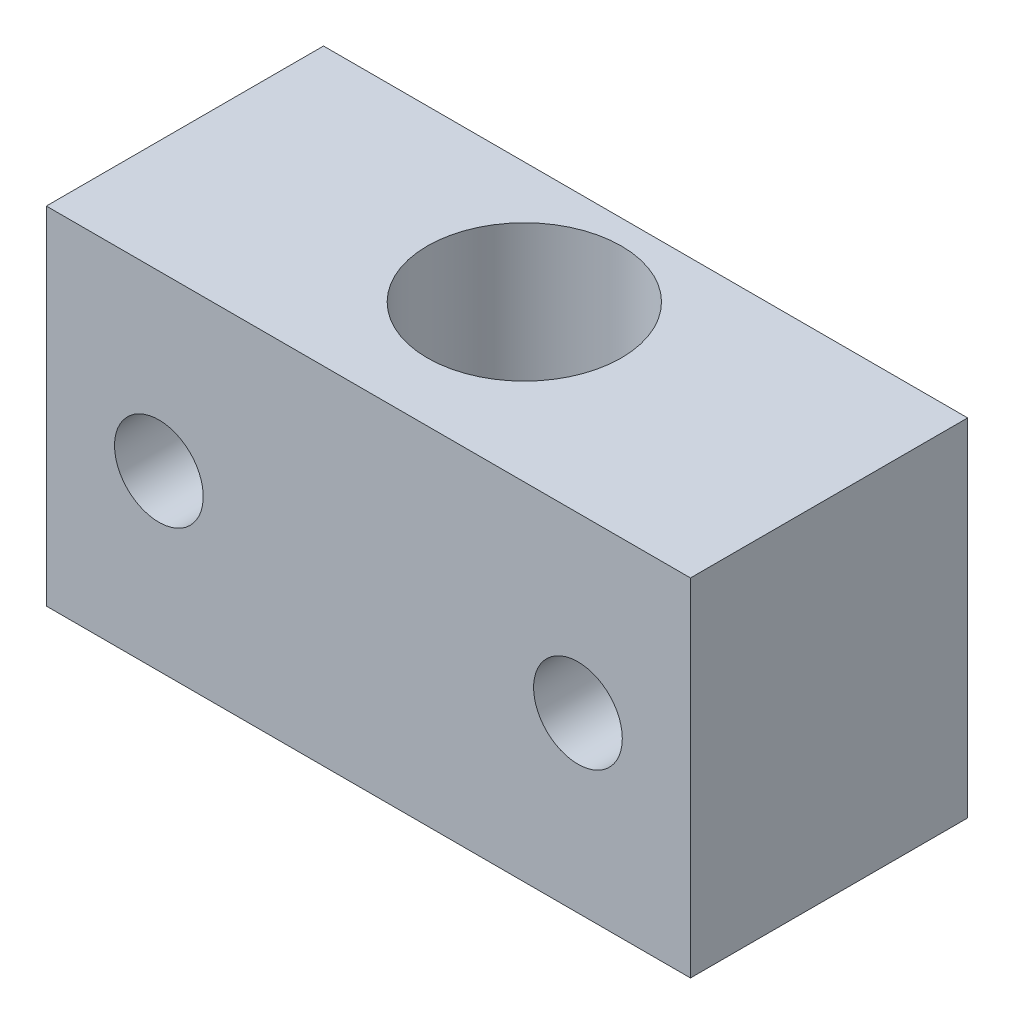
ISO-10303-21;
HEADER;
FILE_DESCRIPTION(('STEP AP214'),'2;1');
FILE_NAME('part.step','',(''),(''),'','','');
FILE_SCHEMA(('AUTOMOTIVE_DESIGN { 1 0 10303 214 1 1 1 1 }'));
ENDSEC;
DATA;
#1=APPLICATION_CONTEXT('core data for automotive mechanical design processes');
#2=APPLICATION_PROTOCOL_DEFINITION('international standard','automotive_design',2000,#1);
#3=PRODUCT_CONTEXT('',#1,'mechanical');
#4=PRODUCT('Part','Part','',(#3));
#5=PRODUCT_RELATED_PRODUCT_CATEGORY('part','',(#4));
#6=PRODUCT_DEFINITION_FORMATION('','',#4);
#7=PRODUCT_DEFINITION_CONTEXT('part definition',#1,'design');
#8=PRODUCT_DEFINITION('design','',#6,#7);
#9=PRODUCT_DEFINITION_SHAPE('','',#8);
#10=(LENGTH_UNIT() NAMED_UNIT(*) SI_UNIT(.MILLI.,.METRE.));
#11=(NAMED_UNIT(*) PLANE_ANGLE_UNIT() SI_UNIT($,.RADIAN.));
#12=(NAMED_UNIT(*) SI_UNIT($,.STERADIAN.) SOLID_ANGLE_UNIT());
#13=UNCERTAINTY_MEASURE_WITH_UNIT(LENGTH_MEASURE(1.E-05),#10,'distance_accuracy_value','');
#14=(GEOMETRIC_REPRESENTATION_CONTEXT(3) GLOBAL_UNCERTAINTY_ASSIGNED_CONTEXT((#13)) GLOBAL_UNIT_ASSIGNED_CONTEXT((#10,
#11,#12)) REPRESENTATION_CONTEXT('',''));
#15=CARTESIAN_POINT('',(0.,0.,0.));
#16=DIRECTION('',(0.,0.,1.));
#17=DIRECTION('',(1.,0.,0.));
#18=AXIS2_PLACEMENT_3D('',#15,#16,#17);
#19=CARTESIAN_POINT('',(0.,15.875,0.));
#20=DIRECTION('',(0.,-1.,0.));
#21=DIRECTION('',(0.,0.,-1.));
#22=AXIS2_PLACEMENT_3D('',#19,#20,#21);
#23=PLANE('',#22);
#24=DIRECTION('',(0.,0.,1.));
#25=VECTOR('',#24,1.);
#26=CARTESIAN_POINT('',(0.,15.875,0.));
#27=LINE('',#26,#25);
#28=CARTESIAN_POINT('',(0.,15.875,-12.7));
#29=VERTEX_POINT('',#28);
#30=CARTESIAN_POINT('',(0.,15.875,0.));
#31=VERTEX_POINT('',#30);
#32=EDGE_CURVE('E87',#29,#31,#27,.T.);
#33=ORIENTED_EDGE('',*,*,#32,.T.);
#34=DIRECTION('',(1.,0.,0.));
#35=VECTOR('',#34,1.);
#36=CARTESIAN_POINT('',(0.,15.875,0.));
#37=LINE('',#36,#35);
#38=CARTESIAN_POINT('',(29.5138969913182,15.875,0.));
#39=VERTEX_POINT('',#38);
#40=EDGE_CURVE('E82',#31,#39,#37,.T.);
#41=ORIENTED_EDGE('',*,*,#40,.T.);
#42=DIRECTION('',(0.,0.,-1.));
#43=VECTOR('',#42,1.);
#44=CARTESIAN_POINT('',(29.5138969913182,15.875,0.));
#45=LINE('',#44,#43);
#46=CARTESIAN_POINT('',(29.5138969913182,15.875,-12.7));
#47=VERTEX_POINT('',#46);
#48=EDGE_CURVE('E85',#39,#47,#45,.T.);
#49=ORIENTED_EDGE('',*,*,#48,.T.);
#50=DIRECTION('',(-1.,0.,0.));
#51=VECTOR('',#50,1.);
#52=CARTESIAN_POINT('',(0.,15.875,-12.7));
#53=LINE('',#52,#51);
#54=EDGE_CURVE('E52',#47,#29,#53,.T.);
#55=ORIENTED_EDGE('',*,*,#54,.T.);
#56=EDGE_LOOP('',(#33,#41,#49,#55));
#57=FACE_BOUND('',#56,.T.);
#58=CARTESIAN_POINT('',(14.7569484956591,15.875,-7.14375));
#59=DIRECTION('',(0.,1.,0.));
#60=DIRECTION('',(0.,0.,1.));
#61=AXIS2_PLACEMENT_3D('',#58,#59,#60);
#62=CIRCLE('',#61,4.445);
#63=CARTESIAN_POINT('',(14.7569484956591,15.875,-2.69875000000001));
#64=VERTEX_POINT('',#63);
#65=EDGE_CURVE('E102',#64,#64,#62,.T.);
#66=ORIENTED_EDGE('',*,*,#65,.F.);
#67=EDGE_LOOP('',(#66));
#68=FACE_BOUND('',#67,.T.);
#69=ADVANCED_FACE('F35',(#57,#68),#23,.F.);
#70=CARTESIAN_POINT('',(0.,0.,0.));
#71=DIRECTION('',(0.,-1.,0.));
#72=DIRECTION('',(0.,0.,-1.));
#73=AXIS2_PLACEMENT_3D('',#70,#71,#72);
#74=PLANE('',#73);
#75=DIRECTION('',(0.,0.,1.));
#76=VECTOR('',#75,1.);
#77=CARTESIAN_POINT('',(0.,0.,0.));
#78=LINE('',#77,#76);
#79=CARTESIAN_POINT('',(0.,0.,-12.7));
#80=VERTEX_POINT('',#79);
#81=CARTESIAN_POINT('',(0.,0.,0.));
#82=VERTEX_POINT('',#81);
#83=EDGE_CURVE('E99',#80,#82,#78,.T.);
#84=ORIENTED_EDGE('',*,*,#83,.F.);
#85=DIRECTION('',(-1.,0.,0.));
#86=VECTOR('',#85,1.);
#87=CARTESIAN_POINT('',(0.,0.,-12.7));
#88=LINE('',#87,#86);
#89=CARTESIAN_POINT('',(29.5138969913182,0.,-12.7));
#90=VERTEX_POINT('',#89);
#91=EDGE_CURVE('E75',#90,#80,#88,.T.);
#92=ORIENTED_EDGE('',*,*,#91,.F.);
#93=DIRECTION('',(0.,0.,-1.));
#94=VECTOR('',#93,1.);
#95=CARTESIAN_POINT('',(29.5138969913182,0.,0.));
#96=LINE('',#95,#94);
#97=CARTESIAN_POINT('',(29.5138969913182,0.,0.));
#98=VERTEX_POINT('',#97);
#99=EDGE_CURVE('E69',#98,#90,#96,.T.);
#100=ORIENTED_EDGE('',*,*,#99,.F.);
#101=DIRECTION('',(1.,0.,0.));
#102=VECTOR('',#101,1.);
#103=CARTESIAN_POINT('',(0.,0.,0.));
#104=LINE('',#103,#102);
#105=EDGE_CURVE('E91',#82,#98,#104,.T.);
#106=ORIENTED_EDGE('',*,*,#105,.F.);
#107=EDGE_LOOP('',(#84,#92,#100,#106));
#108=FACE_BOUND('',#107,.T.);
#109=CARTESIAN_POINT('',(14.7569484956591,0.,-7.14375));
#110=DIRECTION('',(0.,1.,0.));
#111=DIRECTION('',(0.,0.,1.));
#112=AXIS2_PLACEMENT_3D('',#109,#110,#111);
#113=CIRCLE('',#112,4.445);
#114=CARTESIAN_POINT('',(14.7569484956591,0.,-2.69875000000001));
#115=VERTEX_POINT('',#114);
#116=EDGE_CURVE('E114',#115,#115,#113,.T.);
#117=ORIENTED_EDGE('',*,*,#116,.T.);
#118=EDGE_LOOP('',(#117));
#119=FACE_BOUND('',#118,.T.);
#120=ADVANCED_FACE('F110',(#108,#119),#74,.T.);
#121=CARTESIAN_POINT('',(0.,15.875,0.));
#122=DIRECTION('',(1.,0.,0.));
#123=DIRECTION('',(0.,0.,-1.));
#124=AXIS2_PLACEMENT_3D('',#121,#122,#123);
#125=PLANE('',#124);
#126=ORIENTED_EDGE('',*,*,#83,.T.);
#127=DIRECTION('',(0.,-1.,0.));
#128=VECTOR('',#127,1.);
#129=CARTESIAN_POINT('',(0.,15.875,0.));
#130=LINE('',#129,#128);
#131=EDGE_CURVE('E11',#31,#82,#130,.T.);
#132=ORIENTED_EDGE('',*,*,#131,.F.);
#133=ORIENTED_EDGE('',*,*,#32,.F.);
#134=DIRECTION('',(0.,-1.,0.));
#135=VECTOR('',#134,1.);
#136=CARTESIAN_POINT('',(0.,15.875,-12.7));
#137=LINE('',#136,#135);
#138=EDGE_CURVE('E95',#29,#80,#137,.T.);
#139=ORIENTED_EDGE('',*,*,#138,.T.);
#140=EDGE_LOOP('',(#126,#132,#133,#139));
#141=FACE_BOUND('',#140,.T.);
#142=ADVANCED_FACE('F37',(#141),#125,.F.);
#143=CARTESIAN_POINT('',(0.,15.875,0.));
#144=DIRECTION('',(0.,0.,-1.));
#145=DIRECTION('',(-1.,0.,0.));
#146=AXIS2_PLACEMENT_3D('',#143,#144,#145);
#147=PLANE('',#146);
#148=CARTESIAN_POINT('',(24.3579227434887,7.9375,0.));
#149=DIRECTION('',(0.,0.,-1.));
#150=DIRECTION('',(1.,0.,0.));
#151=AXIS2_PLACEMENT_3D('',#148,#149,#150);
#152=CIRCLE('',#151,2.032);
#153=CARTESIAN_POINT('',(26.3899227434887,7.9375,0.));
#154=VERTEX_POINT('',#153);
#155=EDGE_CURVE('E117',#154,#154,#152,.T.);
#156=ORIENTED_EDGE('',*,*,#155,.T.);
#157=EDGE_LOOP('',(#156));
#158=FACE_BOUND('',#157,.T.);
#159=CARTESIAN_POINT('',(5.15597424782956,7.9375,0.));
#160=DIRECTION('',(0.,0.,-1.));
#161=DIRECTION('',(-1.,0.,0.));
#162=AXIS2_PLACEMENT_3D('',#159,#160,#161);
#163=CIRCLE('',#162,2.032);
#164=CARTESIAN_POINT('',(3.12397424782956,7.9375,0.));
#165=VERTEX_POINT('',#164);
#166=EDGE_CURVE('E123',#165,#165,#163,.T.);
#167=ORIENTED_EDGE('',*,*,#166,.T.);
#168=EDGE_LOOP('',(#167));
#169=FACE_BOUND('',#168,.T.);
#170=ORIENTED_EDGE('',*,*,#105,.T.);
#171=DIRECTION('',(0.,-1.,0.));
#172=VECTOR('',#171,1.);
#173=CARTESIAN_POINT('',(29.5138969913182,15.875,0.));
#174=LINE('',#173,#172);
#175=EDGE_CURVE('E44',#39,#98,#174,.T.);
#176=ORIENTED_EDGE('',*,*,#175,.F.);
#177=ORIENTED_EDGE('',*,*,#40,.F.);
#178=ORIENTED_EDGE('',*,*,#131,.T.);
#179=EDGE_LOOP('',(#170,#176,#177,#178));
#180=FACE_BOUND('',#179,.T.);
#181=ADVANCED_FACE('F90',(#158,#169,#180),#147,.F.);
#182=CARTESIAN_POINT('',(29.5138969913182,15.875,0.));
#183=DIRECTION('',(-1.,0.,0.));
#184=DIRECTION('',(0.,0.,1.));
#185=AXIS2_PLACEMENT_3D('',#182,#183,#184);
#186=PLANE('',#185);
#187=ORIENTED_EDGE('',*,*,#99,.T.);
#188=DIRECTION('',(0.,-1.,0.));
#189=VECTOR('',#188,1.);
#190=CARTESIAN_POINT('',(29.5138969913182,15.875,-12.7));
#191=LINE('',#190,#189);
#192=EDGE_CURVE('E92',#47,#90,#191,.T.);
#193=ORIENTED_EDGE('',*,*,#192,.F.);
#194=ORIENTED_EDGE('',*,*,#48,.F.);
#195=ORIENTED_EDGE('',*,*,#175,.T.);
#196=EDGE_LOOP('',(#187,#193,#194,#195));
#197=FACE_BOUND('',#196,.T.);
#198=ADVANCED_FACE('F93',(#197),#186,.F.);
#199=CARTESIAN_POINT('',(0.,15.875,-12.7));
#200=DIRECTION('',(0.,0.,1.));
#201=DIRECTION('',(1.,0.,0.));
#202=AXIS2_PLACEMENT_3D('',#199,#200,#201);
#203=PLANE('',#202);
#204=CARTESIAN_POINT('',(24.3579227434887,7.9375,-12.7));
#205=DIRECTION('',(0.,0.,-1.));
#206=DIRECTION('',(1.,0.,0.));
#207=AXIS2_PLACEMENT_3D('',#204,#205,#206);
#208=CIRCLE('',#207,2.032);
#209=CARTESIAN_POINT('',(26.3899227434887,7.9375,-12.7));
#210=VERTEX_POINT('',#209);
#211=EDGE_CURVE('E126',#210,#210,#208,.T.);
#212=ORIENTED_EDGE('',*,*,#211,.F.);
#213=EDGE_LOOP('',(#212));
#214=FACE_BOUND('',#213,.T.);
#215=CARTESIAN_POINT('',(5.15597424782956,7.9375,-12.7));
#216=DIRECTION('',(0.,0.,-1.));
#217=DIRECTION('',(-1.,0.,0.));
#218=AXIS2_PLACEMENT_3D('',#215,#216,#217);
#219=CIRCLE('',#218,2.032);
#220=CARTESIAN_POINT('',(3.12397424782956,7.9375,-12.7));
#221=VERTEX_POINT('',#220);
#222=EDGE_CURVE('E120',#221,#221,#219,.T.);
#223=ORIENTED_EDGE('',*,*,#222,.F.);
#224=EDGE_LOOP('',(#223));
#225=FACE_BOUND('',#224,.T.);
#226=ORIENTED_EDGE('',*,*,#91,.T.);
#227=ORIENTED_EDGE('',*,*,#138,.F.);
#228=ORIENTED_EDGE('',*,*,#54,.F.);
#229=ORIENTED_EDGE('',*,*,#192,.T.);
#230=EDGE_LOOP('',(#226,#227,#228,#229));
#231=FACE_BOUND('',#230,.T.);
#232=ADVANCED_FACE('F107',(#214,#225,#231),#203,.F.);
#233=CARTESIAN_POINT('',(14.7569484956591,15.875,-7.14375));
#234=DIRECTION('',(0.,-1.,0.));
#235=DIRECTION('',(0.,0.,-1.));
#236=AXIS2_PLACEMENT_3D('',#233,#234,#235);
#237=CYLINDRICAL_SURFACE('',#236,4.445);
#238=ORIENTED_EDGE('',*,*,#65,.T.);
#239=EDGE_LOOP('',(#238));
#240=FACE_BOUND('',#239,.T.);
#241=ORIENTED_EDGE('',*,*,#116,.F.);
#242=EDGE_LOOP('',(#241));
#243=FACE_BOUND('',#242,.T.);
#244=ADVANCED_FACE('F143',(#240,#243),#237,.F.);
#245=CARTESIAN_POINT('',(5.15597424782956,7.9375,0.));
#246=DIRECTION('',(0.,0.,-1.));
#247=DIRECTION('',(-1.,0.,0.));
#248=AXIS2_PLACEMENT_3D('',#245,#246,#247);
#249=CYLINDRICAL_SURFACE('',#248,2.032);
#250=ORIENTED_EDGE('',*,*,#166,.F.);
#251=EDGE_LOOP('',(#250));
#252=FACE_BOUND('',#251,.T.);
#253=ORIENTED_EDGE('',*,*,#222,.T.);
#254=EDGE_LOOP('',(#253));
#255=FACE_BOUND('',#254,.T.);
#256=ADVANCED_FACE('F137',(#252,#255),#249,.F.);
#257=CARTESIAN_POINT('',(24.3579227434887,7.9375,0.));
#258=DIRECTION('',(0.,0.,-1.));
#259=DIRECTION('',(-1.,0.,0.));
#260=AXIS2_PLACEMENT_3D('',#257,#258,#259);
#261=CYLINDRICAL_SURFACE('',#260,2.032);
#262=ORIENTED_EDGE('',*,*,#155,.F.);
#263=EDGE_LOOP('',(#262));
#264=FACE_BOUND('',#263,.T.);
#265=ORIENTED_EDGE('',*,*,#211,.T.);
#266=EDGE_LOOP('',(#265));
#267=FACE_BOUND('',#266,.T.);
#268=ADVANCED_FACE('F134',(#264,#267),#261,.F.);
#269=CLOSED_SHELL('',(#69,#120,#142,#181,#198,#232,#244,#256,#268));
#270=MANIFOLD_SOLID_BREP('B2',#269);
#271=ADVANCED_BREP_SHAPE_REPRESENTATION('',(#18,#270),#14);
#272=SHAPE_DEFINITION_REPRESENTATION(#9,#271);
ENDSEC;
END-ISO-10303-21;
